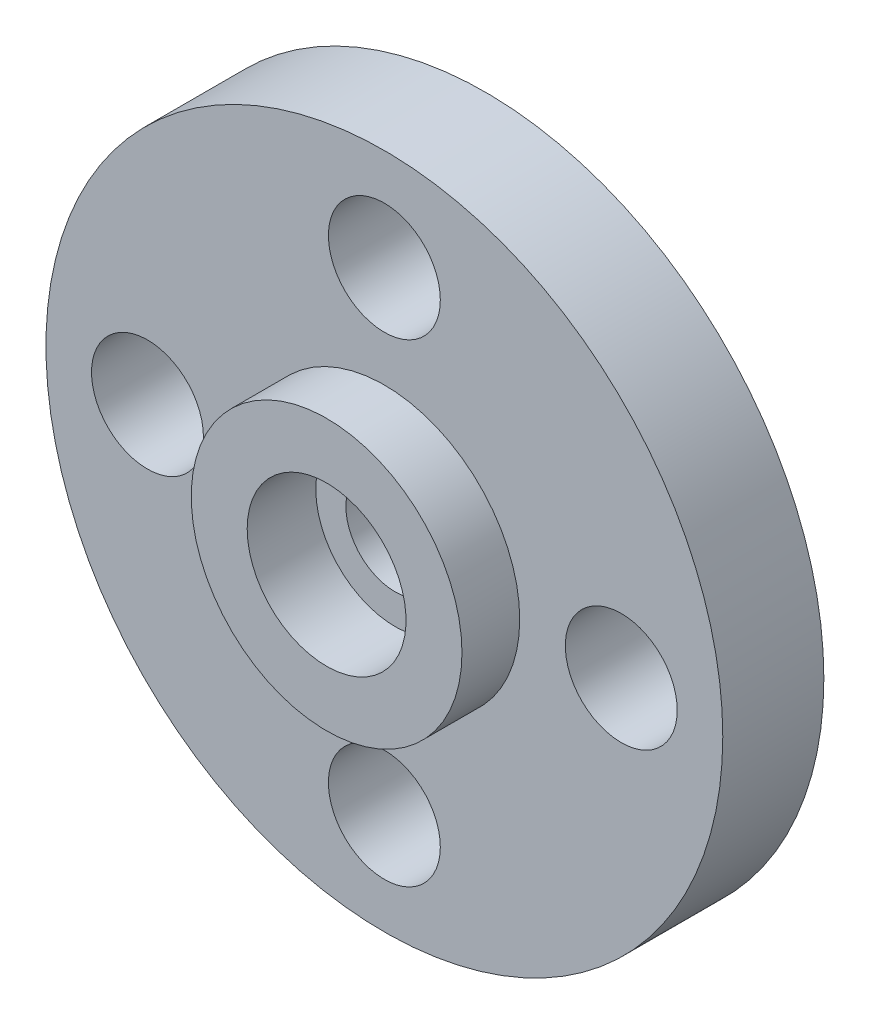
ISO-10303-21;
HEADER;
FILE_DESCRIPTION(('STEP AP214'),'2;1');
FILE_NAME('part.step','',(''),(''),'','','');
FILE_SCHEMA(('AUTOMOTIVE_DESIGN { 1 0 10303 214 1 1 1 1 }'));
ENDSEC;
DATA;
#1=APPLICATION_CONTEXT('core data for automotive mechanical design processes');
#2=APPLICATION_PROTOCOL_DEFINITION('international standard','automotive_design',2000,#1);
#3=PRODUCT_CONTEXT('',#1,'mechanical');
#4=PRODUCT('Part','Part','',(#3));
#5=PRODUCT_RELATED_PRODUCT_CATEGORY('part','',(#4));
#6=PRODUCT_DEFINITION_FORMATION('','',#4);
#7=PRODUCT_DEFINITION_CONTEXT('part definition',#1,'design');
#8=PRODUCT_DEFINITION('design','',#6,#7);
#9=PRODUCT_DEFINITION_SHAPE('','',#8);
#10=(LENGTH_UNIT() NAMED_UNIT(*) SI_UNIT(.MILLI.,.METRE.));
#11=(NAMED_UNIT(*) PLANE_ANGLE_UNIT() SI_UNIT($,.RADIAN.));
#12=(NAMED_UNIT(*) SI_UNIT($,.STERADIAN.) SOLID_ANGLE_UNIT());
#13=UNCERTAINTY_MEASURE_WITH_UNIT(LENGTH_MEASURE(1.E-05),#10,'distance_accuracy_value','');
#14=(GEOMETRIC_REPRESENTATION_CONTEXT(3) GLOBAL_UNCERTAINTY_ASSIGNED_CONTEXT((#13)) GLOBAL_UNIT_ASSIGNED_CONTEXT((#10,
#11,#12)) REPRESENTATION_CONTEXT('',''));
#15=CARTESIAN_POINT('',(0.,0.,0.));
#16=DIRECTION('',(0.,0.,1.));
#17=DIRECTION('',(1.,0.,0.));
#18=AXIS2_PLACEMENT_3D('',#15,#16,#17);
#19=CARTESIAN_POINT('',(0.,0.,0.));
#20=DIRECTION('',(0.,0.,1.));
#21=DIRECTION('',(1.,0.,0.));
#22=AXIS2_PLACEMENT_3D('',#19,#20,#21);
#23=PLANE('',#22);
#24=CARTESIAN_POINT('',(0.,0.,0.));
#25=DIRECTION('',(0.,0.,1.));
#26=DIRECTION('',(1.,0.,0.));
#27=AXIS2_PLACEMENT_3D('',#24,#25,#26);
#28=CIRCLE('',#27,17.526);
#29=CARTESIAN_POINT('',(17.526,0.,0.));
#30=VERTEX_POINT('',#29);
#31=EDGE_CURVE('E41',#30,#30,#28,.T.);
#32=ORIENTED_EDGE('',*,*,#31,.F.);
#33=EDGE_LOOP('',(#32));
#34=FACE_BOUND('',#33,.T.);
#35=CARTESIAN_POINT('',(0.,0.,0.));
#36=DIRECTION('',(0.,0.,1.));
#37=DIRECTION('',(1.,0.,0.));
#38=AXIS2_PLACEMENT_3D('',#35,#36,#37);
#39=CIRCLE('',#38,6.9342);
#40=CARTESIAN_POINT('',(6.9342,0.,0.));
#41=VERTEX_POINT('',#40);
#42=EDGE_CURVE('E89',#41,#41,#39,.T.);
#43=ORIENTED_EDGE('',*,*,#42,.T.);
#44=EDGE_LOOP('',(#43));
#45=FACE_BOUND('',#44,.T.);
#46=ADVANCED_FACE('F37',(#34,#45),#23,.F.);
#47=CARTESIAN_POINT('',(0.,0.,19.05));
#48=DIRECTION('',(0.,0.,-1.));
#49=DIRECTION('',(-1.,0.,0.));
#50=AXIS2_PLACEMENT_3D('',#47,#48,#49);
#51=PLANE('',#50);
#52=CARTESIAN_POINT('',(0.,0.,19.05));
#53=DIRECTION('',(0.,0.,-1.));
#54=DIRECTION('',(-1.,0.,0.));
#55=AXIS2_PLACEMENT_3D('',#52,#53,#54);
#56=CIRCLE('',#55,11.176);
#57=CARTESIAN_POINT('',(-11.176,0.,19.05));
#58=VERTEX_POINT('',#57);
#59=EDGE_CURVE('E85',#58,#58,#56,.T.);
#60=ORIENTED_EDGE('',*,*,#59,.F.);
#61=EDGE_LOOP('',(#60));
#62=FACE_BOUND('',#61,.T.);
#63=CARTESIAN_POINT('',(0.,0.,19.05));
#64=DIRECTION('',(0.,0.,-1.));
#65=DIRECTION('',(-1.,0.,0.));
#66=AXIS2_PLACEMENT_3D('',#63,#64,#65);
#67=CIRCLE('',#66,6.9342);
#68=CARTESIAN_POINT('',(-6.9342,0.,19.05));
#69=VERTEX_POINT('',#68);
#70=EDGE_CURVE('E94',#69,#69,#67,.T.);
#71=ORIENTED_EDGE('',*,*,#70,.T.);
#72=EDGE_LOOP('',(#71));
#73=FACE_BOUND('',#72,.T.);
#74=ADVANCED_FACE('F98',(#62,#73),#51,.F.);
#75=CARTESIAN_POINT('',(0.,0.,28.702));
#76=DIRECTION('',(0.,0.,1.));
#77=DIRECTION('',(1.,0.,0.));
#78=AXIS2_PLACEMENT_3D('',#75,#76,#77);
#79=PLANE('',#78);
#80=CARTESIAN_POINT('',(0.,0.,28.702));
#81=DIRECTION('',(0.,0.,1.));
#82=DIRECTION('',(1.,0.,0.));
#83=AXIS2_PLACEMENT_3D('',#80,#81,#82);
#84=CIRCLE('',#83,19.05);
#85=CARTESIAN_POINT('',(19.05,0.,28.702));
#86=VERTEX_POINT('',#85);
#87=EDGE_CURVE('E53',#86,#86,#84,.T.);
#88=ORIENTED_EDGE('',*,*,#87,.T.);
#89=EDGE_LOOP('',(#88));
#90=FACE_BOUND('',#89,.T.);
#91=CARTESIAN_POINT('',(0.,0.,28.702));
#92=DIRECTION('',(0.,0.,-1.));
#93=DIRECTION('',(-1.,0.,0.));
#94=AXIS2_PLACEMENT_3D('',#91,#92,#93);
#95=CIRCLE('',#94,11.176);
#96=CARTESIAN_POINT('',(-11.176,0.,28.702));
#97=VERTEX_POINT('',#96);
#98=EDGE_CURVE('E86',#97,#97,#95,.T.);
#99=ORIENTED_EDGE('',*,*,#98,.T.);
#100=EDGE_LOOP('',(#99));
#101=FACE_BOUND('',#100,.T.);
#102=ADVANCED_FACE('F112',(#90,#101),#79,.T.);
#103=CARTESIAN_POINT('',(0.,0.,20.574));
#104=DIRECTION('',(0.,0.,1.));
#105=DIRECTION('',(1.,0.,0.));
#106=AXIS2_PLACEMENT_3D('',#103,#104,#105);
#107=PLANE('',#106);
#108=CARTESIAN_POINT('',(2.32794518267366E-13,-33.3375,20.574));
#109=DIRECTION('',(0.,0.,1.));
#110=DIRECTION('',(1.,0.,0.));
#111=AXIS2_PLACEMENT_3D('',#108,#109,#110);
#112=CIRCLE('',#111,7.874);
#113=CARTESIAN_POINT('',(7.87400000000023,-33.3375,20.574));
#114=VERTEX_POINT('',#113);
#115=EDGE_CURVE('E73',#114,#114,#112,.T.);
#116=ORIENTED_EDGE('',*,*,#115,.F.);
#117=EDGE_LOOP('',(#116));
#118=FACE_BOUND('',#117,.T.);
#119=CARTESIAN_POINT('',(0.,33.3375,20.574));
#120=DIRECTION('',(0.,0.,1.));
#121=DIRECTION('',(1.,0.,0.));
#122=AXIS2_PLACEMENT_3D('',#119,#120,#121);
#123=CIRCLE('',#122,7.874);
#124=CARTESIAN_POINT('',(7.874,33.3375,20.574));
#125=VERTEX_POINT('',#124);
#126=EDGE_CURVE('E59',#125,#125,#123,.T.);
#127=ORIENTED_EDGE('',*,*,#126,.F.);
#128=EDGE_LOOP('',(#127));
#129=FACE_BOUND('',#128,.T.);
#130=CARTESIAN_POINT('',(0.,0.,20.574));
#131=DIRECTION('',(0.,0.,1.));
#132=DIRECTION('',(1.,0.,0.));
#133=AXIS2_PLACEMENT_3D('',#130,#131,#132);
#134=CIRCLE('',#133,47.625);
#135=CARTESIAN_POINT('',(47.625,0.,20.574));
#136=VERTEX_POINT('',#135);
#137=EDGE_CURVE('E48',#136,#136,#134,.T.);
#138=ORIENTED_EDGE('',*,*,#137,.T.);
#139=EDGE_LOOP('',(#138));
#140=FACE_BOUND('',#139,.T.);
#141=CARTESIAN_POINT('',(0.,0.,20.574));
#142=DIRECTION('',(0.,0.,1.));
#143=DIRECTION('',(1.,0.,0.));
#144=AXIS2_PLACEMENT_3D('',#141,#142,#143);
#145=CIRCLE('',#144,19.05);
#146=CARTESIAN_POINT('',(19.05,0.,20.574));
#147=VERTEX_POINT('',#146);
#148=EDGE_CURVE('E56',#147,#147,#145,.T.);
#149=ORIENTED_EDGE('',*,*,#148,.F.);
#150=EDGE_LOOP('',(#149));
#151=FACE_BOUND('',#150,.T.);
#152=CARTESIAN_POINT('',(-33.3375,-1.16397259133683E-13,20.574));
#153=DIRECTION('',(0.,0.,1.));
#154=DIRECTION('',(1.,0.,0.));
#155=AXIS2_PLACEMENT_3D('',#152,#153,#154);
#156=CIRCLE('',#155,7.874);
#157=CARTESIAN_POINT('',(-25.4635,-1.16397259133683E-13,20.574));
#158=VERTEX_POINT('',#157);
#159=EDGE_CURVE('E67',#158,#158,#156,.T.);
#160=ORIENTED_EDGE('',*,*,#159,.F.);
#161=EDGE_LOOP('',(#160));
#162=FACE_BOUND('',#161,.T.);
#163=CARTESIAN_POINT('',(33.3375,3.49191777401049E-13,20.574));
#164=DIRECTION('',(0.,0.,1.));
#165=DIRECTION('',(1.,0.,0.));
#166=AXIS2_PLACEMENT_3D('',#163,#164,#165);
#167=CIRCLE('',#166,7.874);
#168=CARTESIAN_POINT('',(41.2115,3.49191777401049E-13,20.574));
#169=VERTEX_POINT('',#168);
#170=EDGE_CURVE('E79',#169,#169,#167,.T.);
#171=ORIENTED_EDGE('',*,*,#170,.F.);
#172=EDGE_LOOP('',(#171));
#173=FACE_BOUND('',#172,.T.);
#174=ADVANCED_FACE('F125',(#118,#129,#140,#151,#162,#173),#107,.T.);
#175=CARTESIAN_POINT('',(0.,0.,6.35));
#176=DIRECTION('',(0.,0.,1.));
#177=DIRECTION('',(1.,0.,0.));
#178=AXIS2_PLACEMENT_3D('',#175,#176,#177);
#179=PLANE('',#178);
#180=CARTESIAN_POINT('',(2.32794518267366E-13,-33.3375,6.35));
#181=DIRECTION('',(0.,0.,1.));
#182=DIRECTION('',(1.,0.,0.));
#183=AXIS2_PLACEMENT_3D('',#180,#181,#182);
#184=CIRCLE('',#183,7.874);
#185=CARTESIAN_POINT('',(7.87400000000023,-33.3375,6.35));
#186=VERTEX_POINT('',#185);
#187=EDGE_CURVE('E76',#186,#186,#184,.T.);
#188=ORIENTED_EDGE('',*,*,#187,.T.);
#189=EDGE_LOOP('',(#188));
#190=FACE_BOUND('',#189,.T.);
#191=CARTESIAN_POINT('',(0.,33.3375,6.35));
#192=DIRECTION('',(0.,0.,1.));
#193=DIRECTION('',(1.,0.,0.));
#194=AXIS2_PLACEMENT_3D('',#191,#192,#193);
#195=CIRCLE('',#194,7.874);
#196=CARTESIAN_POINT('',(7.874,33.3375,6.35));
#197=VERTEX_POINT('',#196);
#198=EDGE_CURVE('E64',#197,#197,#195,.T.);
#199=ORIENTED_EDGE('',*,*,#198,.T.);
#200=EDGE_LOOP('',(#199));
#201=FACE_BOUND('',#200,.T.);
#202=CARTESIAN_POINT('',(0.,0.,6.35));
#203=DIRECTION('',(0.,0.,1.));
#204=DIRECTION('',(1.,0.,0.));
#205=AXIS2_PLACEMENT_3D('',#202,#203,#204);
#206=CIRCLE('',#205,47.625);
#207=CARTESIAN_POINT('',(47.625,0.,6.35));
#208=VERTEX_POINT('',#207);
#209=EDGE_CURVE('E50',#208,#208,#206,.T.);
#210=ORIENTED_EDGE('',*,*,#209,.F.);
#211=EDGE_LOOP('',(#210));
#212=FACE_BOUND('',#211,.T.);
#213=CARTESIAN_POINT('',(0.,0.,6.35));
#214=DIRECTION('',(0.,0.,1.));
#215=DIRECTION('',(1.,0.,0.));
#216=AXIS2_PLACEMENT_3D('',#213,#214,#215);
#217=CIRCLE('',#216,17.526);
#218=CARTESIAN_POINT('',(17.526,0.,6.35));
#219=VERTEX_POINT('',#218);
#220=EDGE_CURVE('E10',#219,#219,#217,.T.);
#221=ORIENTED_EDGE('',*,*,#220,.T.);
#222=EDGE_LOOP('',(#221));
#223=FACE_BOUND('',#222,.T.);
#224=CARTESIAN_POINT('',(-33.3375,-1.16397259133683E-13,6.35));
#225=DIRECTION('',(0.,0.,1.));
#226=DIRECTION('',(1.,0.,0.));
#227=AXIS2_PLACEMENT_3D('',#224,#225,#226);
#228=CIRCLE('',#227,7.874);
#229=CARTESIAN_POINT('',(-25.4635,-1.16397259133683E-13,6.35));
#230=VERTEX_POINT('',#229);
#231=EDGE_CURVE('E70',#230,#230,#228,.T.);
#232=ORIENTED_EDGE('',*,*,#231,.T.);
#233=EDGE_LOOP('',(#232));
#234=FACE_BOUND('',#233,.T.);
#235=CARTESIAN_POINT('',(33.3375,3.49191777401049E-13,6.35));
#236=DIRECTION('',(0.,0.,1.));
#237=DIRECTION('',(1.,0.,0.));
#238=AXIS2_PLACEMENT_3D('',#235,#236,#237);
#239=CIRCLE('',#238,7.874);
#240=CARTESIAN_POINT('',(41.2115,3.49191777401049E-13,6.35));
#241=VERTEX_POINT('',#240);
#242=EDGE_CURVE('E82',#241,#241,#239,.T.);
#243=ORIENTED_EDGE('',*,*,#242,.T.);
#244=EDGE_LOOP('',(#243));
#245=FACE_BOUND('',#244,.T.);
#246=ADVANCED_FACE('F122',(#190,#201,#212,#223,#234,#245),#179,.F.);
#247=CARTESIAN_POINT('',(0.,0.,6.35));
#248=DIRECTION('',(0.,0.,-1.));
#249=DIRECTION('',(-1.,0.,0.));
#250=AXIS2_PLACEMENT_3D('',#247,#248,#249);
#251=CYLINDRICAL_SURFACE('',#250,17.526);
#252=ORIENTED_EDGE('',*,*,#220,.F.);
#253=EDGE_LOOP('',(#252));
#254=FACE_BOUND('',#253,.T.);
#255=ORIENTED_EDGE('',*,*,#31,.T.);
#256=EDGE_LOOP('',(#255));
#257=FACE_BOUND('',#256,.T.);
#258=ADVANCED_FACE('F39',(#254,#257),#251,.T.);
#259=CARTESIAN_POINT('',(0.,0.,20.574));
#260=DIRECTION('',(0.,0.,-1.));
#261=DIRECTION('',(-1.,0.,0.));
#262=AXIS2_PLACEMENT_3D('',#259,#260,#261);
#263=CYLINDRICAL_SURFACE('',#262,47.625);
#264=ORIENTED_EDGE('',*,*,#137,.F.);
#265=EDGE_LOOP('',(#264));
#266=FACE_BOUND('',#265,.T.);
#267=ORIENTED_EDGE('',*,*,#209,.T.);
#268=EDGE_LOOP('',(#267));
#269=FACE_BOUND('',#268,.T.);
#270=ADVANCED_FACE('F117',(#266,#269),#263,.T.);
#271=CARTESIAN_POINT('',(0.,0.,28.702));
#272=DIRECTION('',(0.,0.,-1.));
#273=DIRECTION('',(-1.,0.,0.));
#274=AXIS2_PLACEMENT_3D('',#271,#272,#273);
#275=CYLINDRICAL_SURFACE('',#274,19.05);
#276=ORIENTED_EDGE('',*,*,#87,.F.);
#277=EDGE_LOOP('',(#276));
#278=FACE_BOUND('',#277,.T.);
#279=ORIENTED_EDGE('',*,*,#148,.T.);
#280=EDGE_LOOP('',(#279));
#281=FACE_BOUND('',#280,.T.);
#282=ADVANCED_FACE('F120',(#278,#281),#275,.T.);
#283=CARTESIAN_POINT('',(0.,33.3375,42.8450351802515));
#284=DIRECTION('',(0.,0.,-1.));
#285=DIRECTION('',(-1.,0.,0.));
#286=AXIS2_PLACEMENT_3D('',#283,#284,#285);
#287=CYLINDRICAL_SURFACE('',#286,7.874);
#288=ORIENTED_EDGE('',*,*,#198,.F.);
#289=EDGE_LOOP('',(#288));
#290=FACE_BOUND('',#289,.T.);
#291=ORIENTED_EDGE('',*,*,#126,.T.);
#292=EDGE_LOOP('',(#291));
#293=FACE_BOUND('',#292,.T.);
#294=ADVANCED_FACE('F132',(#290,#293),#287,.F.);
#295=CARTESIAN_POINT('',(-33.3375,-1.16397259133683E-13,42.8450351802515));
#296=DIRECTION('',(0.,0.,-1.));
#297=DIRECTION('',(-1.,0.,0.));
#298=AXIS2_PLACEMENT_3D('',#295,#296,#297);
#299=CYLINDRICAL_SURFACE('',#298,7.874);
#300=ORIENTED_EDGE('',*,*,#231,.F.);
#301=EDGE_LOOP('',(#300));
#302=FACE_BOUND('',#301,.T.);
#303=ORIENTED_EDGE('',*,*,#159,.T.);
#304=EDGE_LOOP('',(#303));
#305=FACE_BOUND('',#304,.T.);
#306=ADVANCED_FACE('F139',(#302,#305),#299,.F.);
#307=CARTESIAN_POINT('',(2.32794518267366E-13,-33.3375,42.8450351802515));
#308=DIRECTION('',(0.,0.,-1.));
#309=DIRECTION('',(-1.,0.,0.));
#310=AXIS2_PLACEMENT_3D('',#307,#308,#309);
#311=CYLINDRICAL_SURFACE('',#310,7.874);
#312=ORIENTED_EDGE('',*,*,#187,.F.);
#313=EDGE_LOOP('',(#312));
#314=FACE_BOUND('',#313,.T.);
#315=ORIENTED_EDGE('',*,*,#115,.T.);
#316=EDGE_LOOP('',(#315));
#317=FACE_BOUND('',#316,.T.);
#318=ADVANCED_FACE('F143',(#314,#317),#311,.F.);
#319=CARTESIAN_POINT('',(33.3375,3.49191777401049E-13,42.8450351802515));
#320=DIRECTION('',(0.,0.,-1.));
#321=DIRECTION('',(-1.,0.,0.));
#322=AXIS2_PLACEMENT_3D('',#319,#320,#321);
#323=CYLINDRICAL_SURFACE('',#322,7.874);
#324=ORIENTED_EDGE('',*,*,#242,.F.);
#325=EDGE_LOOP('',(#324));
#326=FACE_BOUND('',#325,.T.);
#327=ORIENTED_EDGE('',*,*,#170,.T.);
#328=EDGE_LOOP('',(#327));
#329=FACE_BOUND('',#328,.T.);
#330=ADVANCED_FACE('F147',(#326,#329),#323,.F.);
#331=CARTESIAN_POINT('',(0.,0.,19.05));
#332=DIRECTION('',(0.,0.,1.));
#333=DIRECTION('',(1.,0.,0.));
#334=AXIS2_PLACEMENT_3D('',#331,#332,#333);
#335=CYLINDRICAL_SURFACE('',#334,11.176);
#336=ORIENTED_EDGE('',*,*,#59,.T.);
#337=EDGE_LOOP('',(#336));
#338=FACE_BOUND('',#337,.T.);
#339=ORIENTED_EDGE('',*,*,#98,.F.);
#340=EDGE_LOOP('',(#339));
#341=FACE_BOUND('',#340,.T.);
#342=ADVANCED_FACE('F103',(#338,#341),#335,.F.);
#343=CARTESIAN_POINT('',(0.,0.,-0.001000000000001));
#344=DIRECTION('',(0.,0.,1.));
#345=DIRECTION('',(1.,0.,0.));
#346=AXIS2_PLACEMENT_3D('',#343,#344,#345);
#347=CYLINDRICAL_SURFACE('',#346,6.9342);
#348=ORIENTED_EDGE('',*,*,#70,.F.);
#349=EDGE_LOOP('',(#348));
#350=FACE_BOUND('',#349,.T.);
#351=ORIENTED_EDGE('',*,*,#42,.F.);
#352=EDGE_LOOP('',(#351));
#353=FACE_BOUND('',#352,.T.);
#354=ADVANCED_FACE('F100',(#350,#353),#347,.F.);
#355=CLOSED_SHELL('',(#46,#74,#102,#174,#246,#258,#270,#282,#294,#306,#318,#330,#342,#354));
#356=MANIFOLD_SOLID_BREP('B2',#355);
#357=ADVANCED_BREP_SHAPE_REPRESENTATION('',(#18,#356),#14);
#358=SHAPE_DEFINITION_REPRESENTATION(#9,#357);
ENDSEC;
END-ISO-10303-21;
